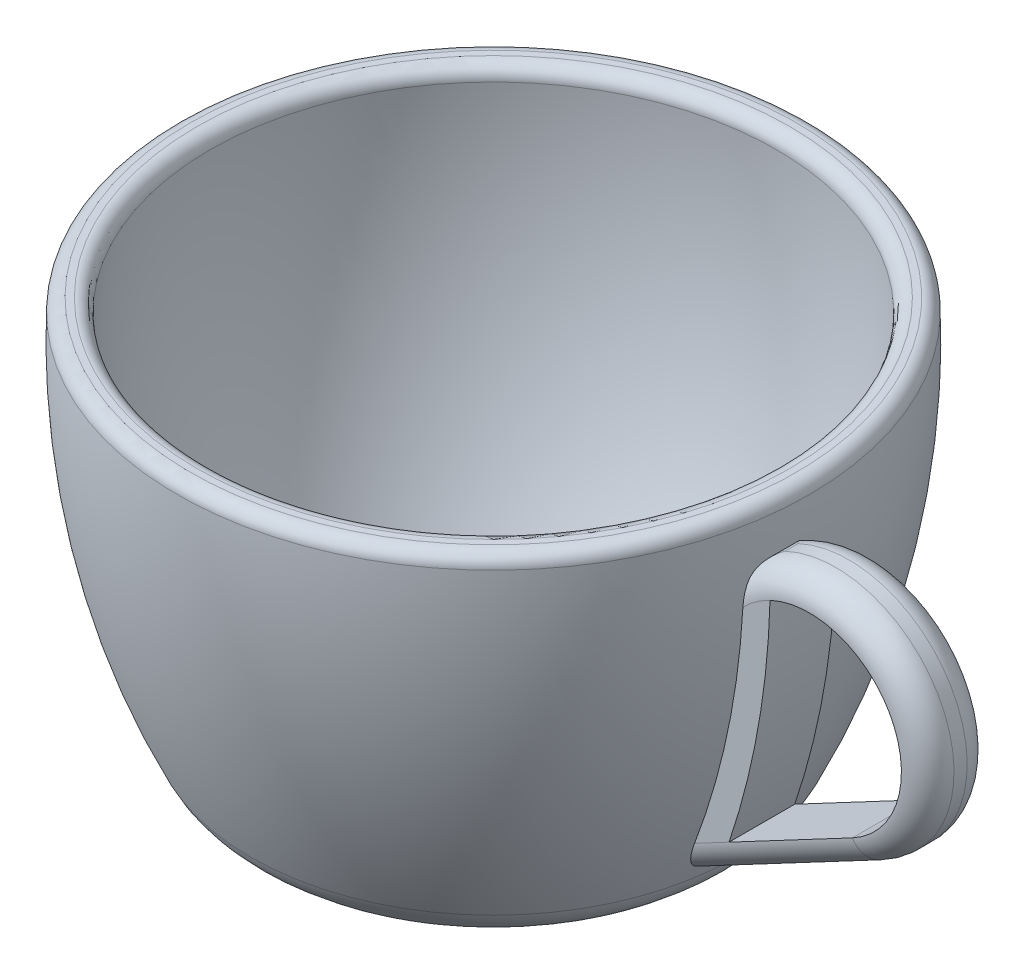
ISO-10303-21;
HEADER;
FILE_DESCRIPTION(('STEP AP214'),'2;1');
FILE_NAME('part.step','',(''),(''),'','','');
FILE_SCHEMA(('AUTOMOTIVE_DESIGN { 1 0 10303 214 1 1 1 1 }'));
ENDSEC;
DATA;
#1=APPLICATION_CONTEXT('core data for automotive mechanical design processes');
#2=APPLICATION_PROTOCOL_DEFINITION('international standard','automotive_design',2000,#1);
#3=PRODUCT_CONTEXT('',#1,'mechanical');
#4=PRODUCT('Part','Part','',(#3));
#5=PRODUCT_RELATED_PRODUCT_CATEGORY('part','',(#4));
#6=PRODUCT_DEFINITION_FORMATION('','',#4);
#7=PRODUCT_DEFINITION_CONTEXT('part definition',#1,'design');
#8=PRODUCT_DEFINITION('design','',#6,#7);
#9=PRODUCT_DEFINITION_SHAPE('','',#8);
#10=(LENGTH_UNIT() NAMED_UNIT(*) SI_UNIT(.MILLI.,.METRE.));
#11=(NAMED_UNIT(*) PLANE_ANGLE_UNIT() SI_UNIT($,.RADIAN.));
#12=(NAMED_UNIT(*) SI_UNIT($,.STERADIAN.) SOLID_ANGLE_UNIT());
#13=UNCERTAINTY_MEASURE_WITH_UNIT(LENGTH_MEASURE(1.E-05),#10,'distance_accuracy_value','');
#14=(GEOMETRIC_REPRESENTATION_CONTEXT(3) GLOBAL_UNCERTAINTY_ASSIGNED_CONTEXT((#13)) GLOBAL_UNIT_ASSIGNED_CONTEXT((#10,
#11,#12)) REPRESENTATION_CONTEXT('',''));
#15=CARTESIAN_POINT('',(0.,0.,0.));
#16=DIRECTION('',(0.,0.,1.));
#17=DIRECTION('',(1.,0.,0.));
#18=AXIS2_PLACEMENT_3D('',#15,#16,#17);
#19=CARTESIAN_POINT('',(-33.9344438469068,12.4931510468309,5.));
#20=DIRECTION('',(0.,0.,-1.));
#21=DIRECTION('',(-1.,0.,0.));
#22=AXIS2_PLACEMENT_3D('',#19,#20,#21);
#23=PLANE('',#22);
#24=CARTESIAN_POINT('',(-33.9344438469068,12.4931510468309,5.));
#25=DIRECTION('',(0.,0.,-1.));
#26=DIRECTION('',(-1.,0.,0.));
#27=AXIS2_PLACEMENT_3D('',#24,#25,#26);
#28=CIRCLE('',#27,58.0000000000086);
#29=CARTESIAN_POINT('',(23.979650500187,9.33757250131607,5.));
#30=VERTEX_POINT('',#29);
#31=CARTESIAN_POINT('',(20.3038871145309,-8.05443894612309,5.));
#32=VERTEX_POINT('',#31);
#33=EDGE_CURVE('E148',#30,#32,#28,.T.);
#34=ORIENTED_EDGE('',*,*,#33,.T.);
#35=DIRECTION('',(0.88350934420725,0.468413533854943,0.));
#36=VECTOR('',#35,1.);
#37=CARTESIAN_POINT('',(-13.5303709056327,-25.9924771440158,5.));
#38=LINE('',#37,#36);
#39=CARTESIAN_POINT('',(22.92475168972,-6.66492513342984,5.));
#40=VERTEX_POINT('',#39);
#41=EDGE_CURVE('E132',#32,#40,#38,.T.);
#42=ORIENTED_EDGE('',*,*,#41,.T.);
#43=CARTESIAN_POINT('',(-33.9344438469068,12.4931510468309,5.));
#44=DIRECTION('',(0.,0.,-1.));
#45=DIRECTION('',(-1.,0.,0.));
#46=AXIS2_PLACEMENT_3D('',#43,#44,#45);
#47=CIRCLE('',#46,60.0000000000086);
#48=CARTESIAN_POINT('',(26.0423836387926,10.8257684417625,5.));
#49=VERTEX_POINT('',#48);
#50=EDGE_CURVE('E140',#49,#40,#47,.T.);
#51=ORIENTED_EDGE('',*,*,#50,.F.);
#52=CARTESIAN_POINT('',(29.0384749984246,4.49936056961745,5.));
#53=DIRECTION('',(0.,0.,-1.));
#54=DIRECTION('',(-1.,0.,0.));
#55=AXIS2_PLACEMENT_3D('',#52,#53,#54);
#56=CIRCLE('',#55,6.99999999999999);
#57=EDGE_CURVE('E150',#49,#30,#56,.F.);
#58=ORIENTED_EDGE('',*,*,#57,.T.);
#59=EDGE_LOOP('',(#34,#42,#51,#58));
#60=FACE_BOUND('',#59,.T.);
#61=ADVANCED_FACE('F55',(#60),#23,.F.);
#62=CARTESIAN_POINT('',(-33.9344438469068,12.4931510468309,0.));
#63=DIRECTION('',(0.,0.,-1.));
#64=DIRECTION('',(-1.,0.,0.));
#65=AXIS2_PLACEMENT_3D('',#62,#63,#64);
#66=PLANE('',#65);
#67=CARTESIAN_POINT('',(-33.9344438469068,12.4931510468309,0.));
#68=DIRECTION('',(0.,0.,-1.));
#69=DIRECTION('',(-1.,0.,0.));
#70=AXIS2_PLACEMENT_3D('',#67,#68,#69);
#71=CIRCLE('',#70,60.0000000000086);
#72=CARTESIAN_POINT('',(26.0423836387926,10.8257684417625,0.));
#73=VERTEX_POINT('',#72);
#74=CARTESIAN_POINT('',(22.92475168972,-6.66492513342984,0.));
#75=VERTEX_POINT('',#74);
#76=EDGE_CURVE('E285',#73,#75,#71,.T.);
#77=ORIENTED_EDGE('',*,*,#76,.T.);
#78=DIRECTION('',(0.88350934420725,0.468413533854943,0.));
#79=VECTOR('',#78,1.);
#80=CARTESIAN_POINT('',(18.1812202280932,-9.17982138151238,0.));
#81=LINE('',#80,#79);
#82=CARTESIAN_POINT('',(20.3038871145309,-8.05443894612309,0.));
#83=VERTEX_POINT('',#82);
#84=EDGE_CURVE('E230',#75,#83,#81,.F.);
#85=ORIENTED_EDGE('',*,*,#84,.T.);
#86=CARTESIAN_POINT('',(-33.9344438469068,12.4931510468309,0.));
#87=DIRECTION('',(0.,0.,-1.));
#88=DIRECTION('',(-1.,0.,0.));
#89=AXIS2_PLACEMENT_3D('',#86,#87,#88);
#90=CIRCLE('',#89,58.0000000000086);
#91=CARTESIAN_POINT('',(23.979650500187,9.33757250131606,0.));
#92=VERTEX_POINT('',#91);
#93=EDGE_CURVE('E166',#92,#83,#90,.T.);
#94=ORIENTED_EDGE('',*,*,#93,.F.);
#95=CARTESIAN_POINT('',(29.0384749984246,4.49936056961745,0.));
#96=DIRECTION('',(0.,0.,-1.));
#97=DIRECTION('',(-1.,0.,0.));
#98=AXIS2_PLACEMENT_3D('',#95,#96,#97);
#99=CIRCLE('',#98,6.99999999999999);
#100=EDGE_CURVE('E228',#92,#73,#99,.T.);
#101=ORIENTED_EDGE('',*,*,#100,.T.);
#102=EDGE_LOOP('',(#77,#85,#94,#101));
#103=FACE_BOUND('',#102,.T.);
#104=ADVANCED_FACE('F202',(#103),#66,.T.);
#105=CARTESIAN_POINT('',(-33.9344438469068,12.4931510468309,5.));
#106=DIRECTION('',(0.,0.,-1.));
#107=DIRECTION('',(-1.,0.,0.));
#108=AXIS2_PLACEMENT_3D('',#105,#106,#107);
#109=CYLINDRICAL_SURFACE('',#108,58.0000000000086);
#110=DIRECTION('',(0.,0.,-1.));
#111=VECTOR('',#110,1.);
#112=CARTESIAN_POINT('',(19.1180472958031,-10.9468400699269,5.));
#113=LINE('',#112,#111);
#114=CARTESIAN_POINT('',(19.1180472958031,-10.9468400699269,3.));
#115=VERTEX_POINT('',#114);
#116=CARTESIAN_POINT('',(19.1180472958031,-10.9468400699269,2.));
#117=VERTEX_POINT('',#116);
#118=EDGE_CURVE('E177',#115,#117,#113,.T.);
#119=ORIENTED_EDGE('',*,*,#118,.F.);
#120=CARTESIAN_POINT('',(19.1180472958031,-10.9468400699269,3.));
#121=CARTESIAN_POINT('',(19.1180383720661,-10.9468591006645,3.04198652230094));
#122=CARTESIAN_POINT('',(19.1189104072404,-10.9448865424429,3.08396066699407));
#123=CARTESIAN_POINT('',(19.1223472936523,-10.9371060238736,3.16743222638179));
#124=CARTESIAN_POINT('',(19.124910079574,-10.9313027428937,3.20893015994375));
#125=CARTESIAN_POINT('',(19.1316210139958,-10.9160955011322,3.29063101706186));
#126=CARTESIAN_POINT('',(19.1357506655537,-10.9067335483823,3.3308433297919));
#127=CARTESIAN_POINT('',(19.1454799642096,-10.8846554072489,3.4101491778386));
#128=CARTESIAN_POINT('',(19.1510799638252,-10.8719384144874,3.44924244236623));
#129=CARTESIAN_POINT('',(19.169826745053,-10.8293145779611,3.56407889647573));
#130=CARTESIAN_POINT('',(19.1849609553938,-10.7948431604463,3.63784404124475));
#131=CARTESIAN_POINT('',(19.2194180851132,-10.7160888318405,3.77899202916436));
#132=CARTESIAN_POINT('',(19.2387541460896,-10.6717751284496,3.84635387326327));
#133=CARTESIAN_POINT('',(19.2918895993683,-10.5495030587468,4.00899183548718));
#134=CARTESIAN_POINT('',(19.3278504233503,-10.4663214193271,4.09962668267455));
#135=CARTESIAN_POINT('',(19.4044110303572,-10.2878946371221,4.26574056109083));
#136=CARTESIAN_POINT('',(19.4450209054874,-10.1926231994255,4.34118560097877));
#137=CARTESIAN_POINT('',(19.5192958606613,-10.0169488375787,4.4623574744141));
#138=CARTESIAN_POINT('',(19.5523873604535,-9.93822180984106,4.51091862792134));
#139=CARTESIAN_POINT('',(19.6197019820223,-9.77703350951446,4.60050237528889));
#140=CARTESIAN_POINT('',(19.6539257081746,-9.69457023356824,4.64152086373386));
#141=CARTESIAN_POINT('',(19.7577879171872,-9.44259857931204,4.75412991041568));
#142=CARTESIAN_POINT('',(19.8285339913527,-9.26870511122798,4.81514412981452));
#143=CARTESIAN_POINT('',(19.9334803560236,-9.00696919844892,4.88617957895021));
#144=CARTESIAN_POINT('',(19.9675018136656,-8.92153643109256,4.90620103971343));
#145=CARTESIAN_POINT('',(20.035538928121,-8.74948271775906,4.94046090184195));
#146=CARTESIAN_POINT('',(20.0695545846984,-8.66286173157012,4.9546991069882));
#147=CARTESIAN_POINT('',(20.1371415138695,-8.48951423289946,4.97736671419318));
#148=CARTESIAN_POINT('',(20.1707141616427,-8.402794151192,4.98584183538718));
#149=CARTESIAN_POINT('',(20.237557204388,-8.22889056279537,4.99715214068028));
#150=CARTESIAN_POINT('',(20.2708276573022,-8.14170715025212,4.9999884296908));
#151=CARTESIAN_POINT('',(20.3038871145309,-8.05443894612309,5.));
#152=B_SPLINE_CURVE_WITH_KNOTS('',3,(#120,#121,#122,#123,#124,#125,#126,#127,#128,#129,#130,
#131,#132,#133,#134,#135,#136,#137,#138,#139,#140,#141,#142,#143,#144,#145,#146,#147,#148,#149,
#150,#151),.UNSPECIFIED.,.F.,.F.,(4,2,2,2,2,2,2,2,2,2,2,2,2,2,2,4),(0.,0.125884252717793,
0.251615017080443,0.375905510099908,0.500225829148167,0.747458825417953,0.995476484935828,
1.37782245928309,1.76101475323589,2.05533907578022,2.3498231256771,2.93953314367444,
3.2217537689636,3.50398396886672,3.78394823763495,4.06385764287641),.UNSPECIFIED.);
#153=EDGE_CURVE('E222',#115,#32,#152,.T.);
#154=ORIENTED_EDGE('',*,*,#153,.T.);
#155=ORIENTED_EDGE('',*,*,#33,.F.);
#156=CARTESIAN_POINT('',(23.979650500187,9.33757250131607,5.));
#157=CARTESIAN_POINT('',(23.9855306458572,9.44542889756805,4.99999922222326));
#158=CARTESIAN_POINT('',(23.9911084251859,9.55340322261701,4.99629109998169));
#159=CARTESIAN_POINT('',(24.0016541328101,9.76915449911496,4.98035081185393));
#160=CARTESIAN_POINT('',(24.0066196331699,9.87692909442817,4.96808591807795));
#161=CARTESIAN_POINT('',(24.0157711850718,10.0882604575923,4.93434416829314));
#162=CARTESIAN_POINT('',(24.0199739576839,10.1918545175633,4.91311157699099));
#163=CARTESIAN_POINT('',(24.027735696474,10.3964412876877,4.8605071964157));
#164=CARTESIAN_POINT('',(24.0312951673708,10.4974359834134,4.82914341015939));
#165=CARTESIAN_POINT('',(24.036118809861,10.6448470238442,4.77423441654213));
#166=CARTESIAN_POINT('',(24.0376277747064,10.692829933206,4.75485929205889));
#167=CARTESIAN_POINT('',(24.040502354656,10.7878968805384,4.71325971507097));
#168=CARTESIAN_POINT('',(24.0418670375851,10.8349736353282,4.69101857688393));
#169=CARTESIAN_POINT('',(24.0431560559362,10.8813478619307,4.66735495396323));
#170=B_SPLINE_CURVE_WITH_KNOTS('',3,(#156,#157,#158,#159,#160,#161,#162,#163,#164,#165,#166,
#167,#168,#169),.UNSPECIFIED.,.F.,.F.,(4,2,2,2,2,2,4),(0.,0.324141067811307,0.649528754218161,
0.966573271004194,1.28336795220429,1.43859947817178,1.59477944512941),.UNSPECIFIED.);
#171=CARTESIAN_POINT('',(24.0431560559363,10.8813478619314,4.66735495396513));
#172=VERTEX_POINT('',#171);
#173=EDGE_CURVE('E211',#30,#172,#170,.T.);
#174=ORIENTED_EDGE('',*,*,#173,.T.);
#175=DIRECTION('',(0.,0.,-1.));
#176=VECTOR('',#175,1.);
#177=CARTESIAN_POINT('',(24.0431560559363,10.8813478619314,5.));
#178=LINE('',#177,#176);
#179=CARTESIAN_POINT('',(24.0431560559363,10.8813478619314,0.332645046034874));
#180=VERTEX_POINT('',#179);
#181=EDGE_CURVE('E191',#172,#180,#178,.T.);
#182=ORIENTED_EDGE('',*,*,#181,.T.);
#183=CARTESIAN_POINT('',(24.0431560559363,10.8813478619314,0.332645046034874));
#184=CARTESIAN_POINT('',(24.0389287776286,10.7281186675877,0.254496657091173));
#185=CARTESIAN_POINT('',(24.0338378779418,10.5679551165019,0.19210444475637));
#186=CARTESIAN_POINT('',(24.0220735191729,10.2421049468039,0.0956215084239027));
#187=CARTESIAN_POINT('',(24.0154275684948,10.0765531261709,0.0610806435948221));
#188=CARTESIAN_POINT('',(24.0037859415494,9.81534427392305,0.0248382672662205));
#189=CARTESIAN_POINT('',(23.9993279588872,9.72057337151516,0.0153890029875285));
#190=CARTESIAN_POINT('',(23.9898797316114,9.52972544003635,0.00294488873088613));
#191=CARTESIAN_POINT('',(23.9848848610897,9.43364452502137,1.17900879466671E-05));
#192=CARTESIAN_POINT('',(23.979650500187,9.33757250131609,0.));
#193=B_SPLINE_CURVE_WITH_KNOTS('',3,(#183,#184,#185,#186,#187,#188,#189,#190,#191,#192),
.UNSPECIFIED.,.F.,.F.,(4,2,2,2,4),(0.,0.513999061969984,1.01951415138709,1.30537715686424,
1.5939378301652),.UNSPECIFIED.);
#194=EDGE_CURVE('E184',#180,#92,#193,.T.);
#195=ORIENTED_EDGE('',*,*,#194,.T.);
#196=ORIENTED_EDGE('',*,*,#93,.T.);
#197=CARTESIAN_POINT('',(20.3038871145309,-8.05443894612309,0.));
#198=CARTESIAN_POINT('',(20.2587129076957,-8.1736943350833,4.00640838798604E-05));
#199=CARTESIAN_POINT('',(20.2131364149355,-8.29280164679401,0.00531935700981928));
#200=CARTESIAN_POINT('',(20.1214510633159,-8.53008137896897,0.0264157691534799));
#201=CARTESIAN_POINT('',(20.0753414982934,-8.64825209573898,0.042248954270796));
#202=CARTESIAN_POINT('',(19.9824914649804,-8.88394732182593,0.0847464253487183));
#203=CARTESIAN_POINT('',(19.9357496595705,-9.00145022581416,0.111528576821379));
#204=CARTESIAN_POINT('',(19.8426263253745,-9.23338397401962,0.176262742910312));
#205=CARTESIAN_POINT('',(19.7962445448154,-9.34781713486548,0.214206060130653));
#206=CARTESIAN_POINT('',(19.6930924521852,-9.6000640560021,0.312659237541656));
#207=CARTESIAN_POINT('',(19.636562657342,-9.73673286471966,0.376420880807846));
#208=CARTESIAN_POINT('',(19.5266417225377,-9.99979217887641,0.524035138890257));
#209=CARTESIAN_POINT('',(19.4732406937294,-10.1262156125797,0.607819668265291));
#210=CARTESIAN_POINT('',(19.3874861022327,-10.327452100725,0.769376797078972));
#211=CARTESIAN_POINT('',(19.3536527143185,-10.4063076440599,0.841299192245829));
#212=CARTESIAN_POINT('',(19.2902763648631,-10.55322645246,0.997218264634828));
#213=CARTESIAN_POINT('',(19.2607284719517,-10.6213021304641,1.0812008389062));
#214=CARTESIAN_POINT('',(19.2148304841641,-10.7266048797918,1.23833956572202));
#215=CARTESIAN_POINT('',(19.1970387015408,-10.7672667533558,1.30875513141013));
#216=CARTESIAN_POINT('',(19.166183562498,-10.8376193100259,1.45570012954377));
#217=CARTESIAN_POINT('',(19.153106051133,-10.8673428420051,1.53221040300944));
#218=CARTESIAN_POINT('',(19.1348664009172,-10.908744524781,1.67362722570798));
#219=CARTESIAN_POINT('',(19.1286273022107,-10.9228817748925,1.7376666583175));
#220=CARTESIAN_POINT('',(19.1223154259973,-10.9371780248553,1.83511955678588));
#221=CARTESIAN_POINT('',(19.120719082092,-10.940792225123,1.86795482380584));
#222=CARTESIAN_POINT('',(19.1185835240137,-10.9456264395008,1.93385562734035));
#223=CARTESIAN_POINT('',(19.1180449764815,-10.9468449438041,1.96692129589512));
#224=CARTESIAN_POINT('',(19.1180472958031,-10.9468400699269,2.));
#225=B_SPLINE_CURVE_WITH_KNOTS('',3,(#197,#198,#199,#200,#201,#202,#203,#204,#205,#206,#207,
#208,#209,#210,#211,#212,#213,#214,#215,#216,#217,#218,#219,#220,#221,#222,#223,#224),
.UNSPECIFIED.,.F.,.F.,(4,2,2,2,2,2,2,2,2,2,2,2,2,4),(0.,0.382473523411586,0.765530609468054,
1.15282468366985,1.53981775288919,2.02167556982793,2.50191763375422,2.83686492349636,
3.17142367425086,3.42024945605859,3.66832177185763,3.86515827904918,3.96428046960581,
4.06346510859768),.UNSPECIFIED.);
#226=EDGE_CURVE('E217',#83,#117,#225,.T.);
#227=ORIENTED_EDGE('',*,*,#226,.T.);
#228=EDGE_LOOP('',(#119,#154,#155,#174,#182,#195,#196,#227));
#229=FACE_BOUND('',#228,.T.);
#230=ADVANCED_FACE('F196',(#229),#109,.F.);
#231=CARTESIAN_POINT('',(19.1180472958031,-10.9468400699269,5.));
#232=DIRECTION('',(-0.468413533854943,0.88350934420725,0.));
#233=DIRECTION('',(-0.88350934420725,-0.468413533854943,0.));
#234=AXIS2_PLACEMENT_3D('',#231,#232,#233);
#235=PLANE('',#234);
#236=DIRECTION('',(0.,0.,-1.));
#237=VECTOR('',#236,1.);
#238=CARTESIAN_POINT('',(33.2541968031191,-3.4522235282478,5.));
#239=LINE('',#238,#237);
#240=CARTESIAN_POINT('',(33.2541968031191,-3.4522235282478,3.));
#241=VERTEX_POINT('',#240);
#242=CARTESIAN_POINT('',(33.2541968031191,-3.4522235282478,2.));
#243=VERTEX_POINT('',#242);
#244=EDGE_CURVE('E174',#241,#243,#239,.T.);
#245=ORIENTED_EDGE('',*,*,#244,.F.);
#246=DIRECTION('',(0.88350934420725,0.468413533854943,0.));
#247=VECTOR('',#246,1.);
#248=CARTESIAN_POINT('',(19.1180472958031,-10.9468400699269,3.));
#249=LINE('',#248,#247);
#250=EDGE_CURVE('E182',#241,#115,#249,.F.);
#251=ORIENTED_EDGE('',*,*,#250,.T.);
#252=ORIENTED_EDGE('',*,*,#118,.T.);
#253=DIRECTION('',(0.88350934420725,0.468413533854943,0.));
#254=VECTOR('',#253,1.);
#255=CARTESIAN_POINT('',(33.2541968031191,-3.4522235282478,2.));
#256=LINE('',#255,#254);
#257=EDGE_CURVE('E149',#117,#243,#256,.T.);
#258=ORIENTED_EDGE('',*,*,#257,.T.);
#259=EDGE_LOOP('',(#245,#251,#252,#258));
#260=FACE_BOUND('',#259,.T.);
#261=ADVANCED_FACE('F201',(#260),#235,.F.);
#262=CARTESIAN_POINT('',(29.0384749984246,4.49936056961745,5.));
#263=DIRECTION('',(0.,0.,-1.));
#264=DIRECTION('',(-1.,0.,0.));
#265=AXIS2_PLACEMENT_3D('',#262,#263,#264);
#266=CYLINDRICAL_SURFACE('',#265,8.99999999999999);
#267=DIRECTION('',(0.,0.,-1.));
#268=VECTOR('',#267,1.);
#269=CARTESIAN_POINT('',(25.1863575360406,12.6333135480896,5.));
#270=LINE('',#269,#268);
#271=CARTESIAN_POINT('',(25.1863575360406,12.6333135480896,2.));
#272=VERTEX_POINT('',#271);
#273=CARTESIAN_POINT('',(25.1863575360406,12.6333135480896,3.));
#274=VERTEX_POINT('',#273);
#275=EDGE_CURVE('E65',#272,#274,#270,.F.);
#276=ORIENTED_EDGE('',*,*,#275,.T.);
#277=CARTESIAN_POINT('',(29.0384749984246,4.49936056961745,3.));
#278=DIRECTION('',(0.,0.,-1.));
#279=DIRECTION('',(-1.,0.,0.));
#280=AXIS2_PLACEMENT_3D('',#277,#278,#279);
#281=CIRCLE('',#280,8.99999999999999);
#282=EDGE_CURVE('E12',#274,#241,#281,.T.);
#283=ORIENTED_EDGE('',*,*,#282,.T.);
#284=ORIENTED_EDGE('',*,*,#244,.T.);
#285=CARTESIAN_POINT('',(29.0384749984246,4.49936056961745,2.));
#286=DIRECTION('',(0.,0.,-1.));
#287=DIRECTION('',(-1.,0.,0.));
#288=AXIS2_PLACEMENT_3D('',#285,#286,#287);
#289=CIRCLE('',#288,8.99999999999999);
#290=EDGE_CURVE('E76',#243,#272,#289,.F.);
#291=ORIENTED_EDGE('',*,*,#290,.T.);
#292=EDGE_LOOP('',(#276,#283,#284,#291));
#293=FACE_BOUND('',#292,.T.);
#294=ADVANCED_FACE('F267',(#293),#266,.T.);
#295=CARTESIAN_POINT('',(-33.9344438469068,12.4931510468309,5.));
#296=DIRECTION('',(0.,0.,-1.));
#297=DIRECTION('',(-1.,0.,0.));
#298=AXIS2_PLACEMENT_3D('',#295,#296,#297);
#299=CYLINDRICAL_SURFACE('',#298,60.0000000000086);
#300=ORIENTED_EDGE('',*,*,#76,.F.);
#301=DIRECTION('',(0.,0.,-1.));
#302=VECTOR('',#301,1.);
#303=CARTESIAN_POINT('',(26.0423836387926,10.8257684417625,5.));
#304=LINE('',#303,#302);
#305=EDGE_CURVE('E160',#49,#73,#304,.T.);
#306=ORIENTED_EDGE('',*,*,#305,.F.);
#307=ORIENTED_EDGE('',*,*,#50,.T.);
#308=DIRECTION('',(0.,0.,-1.));
#309=VECTOR('',#308,1.);
#310=CARTESIAN_POINT('',(22.92475168972,-6.66492513342984,5.));
#311=LINE('',#310,#309);
#312=EDGE_CURVE('E157',#40,#75,#311,.T.);
#313=ORIENTED_EDGE('',*,*,#312,.T.);
#314=EDGE_LOOP('',(#300,#306,#307,#313));
#315=FACE_BOUND('',#314,.T.);
#316=ADVANCED_FACE('F156',(#315),#299,.T.);
#317=CARTESIAN_POINT('',(22.92475168972,-6.66492513342984,5.));
#318=DIRECTION('',(-0.468413533854944,0.883509344207249,0.));
#319=DIRECTION('',(-0.883509344207249,-0.468413533854944,0.));
#320=AXIS2_PLACEMENT_3D('',#317,#318,#319);
#321=PLANE('',#320);
#322=DIRECTION('',(0.883509344207249,0.468413533854944,0.));
#323=VECTOR('',#322,1.);
#324=CARTESIAN_POINT('',(22.92475168972,-6.66492513342984,0.));
#325=LINE('',#324,#323);
#326=CARTESIAN_POINT('',(32.3173697354092,-1.6852048398333,0.));
#327=VERTEX_POINT('',#326);
#328=EDGE_CURVE('E165',#75,#327,#325,.T.);
#329=ORIENTED_EDGE('',*,*,#328,.F.);
#330=ORIENTED_EDGE('',*,*,#312,.F.);
#331=DIRECTION('',(0.883509344207249,0.468413533854944,0.));
#332=VECTOR('',#331,1.);
#333=CARTESIAN_POINT('',(22.92475168972,-6.66492513342984,5.));
#334=LINE('',#333,#332);
#335=CARTESIAN_POINT('',(32.3173697354092,-1.6852048398333,5.));
#336=VERTEX_POINT('',#335);
#337=EDGE_CURVE('E128',#40,#336,#334,.T.);
#338=ORIENTED_EDGE('',*,*,#337,.T.);
#339=DIRECTION('',(0.,0.,-1.));
#340=VECTOR('',#339,1.);
#341=CARTESIAN_POINT('',(32.3173697354092,-1.6852048398333,5.));
#342=LINE('',#341,#340);
#343=EDGE_CURVE('E167',#336,#327,#342,.T.);
#344=ORIENTED_EDGE('',*,*,#343,.T.);
#345=EDGE_LOOP('',(#329,#330,#338,#344));
#346=FACE_BOUND('',#345,.T.);
#347=ADVANCED_FACE('F163',(#346),#321,.T.);
#348=CARTESIAN_POINT('',(29.0384749984246,4.49936056961745,5.));
#349=DIRECTION('',(0.,0.,-1.));
#350=DIRECTION('',(-1.,0.,0.));
#351=AXIS2_PLACEMENT_3D('',#348,#349,#350);
#352=CYLINDRICAL_SURFACE('',#351,6.99999999999999);
#353=CARTESIAN_POINT('',(29.0384749984246,4.49936056961745,0.));
#354=DIRECTION('',(0.,0.,1.));
#355=DIRECTION('',(-1.,0.,0.));
#356=AXIS2_PLACEMENT_3D('',#353,#354,#355);
#357=CIRCLE('',#356,6.99999999999999);
#358=EDGE_CURVE('E161',#327,#73,#357,.T.);
#359=ORIENTED_EDGE('',*,*,#358,.F.);
#360=ORIENTED_EDGE('',*,*,#343,.F.);
#361=CARTESIAN_POINT('',(29.0384749984246,4.49936056961745,5.));
#362=DIRECTION('',(0.,0.,1.));
#363=DIRECTION('',(-1.,0.,0.));
#364=AXIS2_PLACEMENT_3D('',#361,#362,#363);
#365=CIRCLE('',#364,6.99999999999999);
#366=EDGE_CURVE('E139',#336,#49,#365,.T.);
#367=ORIENTED_EDGE('',*,*,#366,.T.);
#368=ORIENTED_EDGE('',*,*,#305,.T.);
#369=EDGE_LOOP('',(#359,#360,#367,#368));
#370=FACE_BOUND('',#369,.T.);
#371=ADVANCED_FACE('F294',(#370),#352,.F.);
#372=CARTESIAN_POINT('',(18.1812202280932,-9.17982138151238,2.));
#373=DIRECTION('',(-0.88350934420725,-0.468413533854943,0.));
#374=DIRECTION('',(0.468413533854943,-0.88350934420725,0.));
#375=AXIS2_PLACEMENT_3D('',#372,#373,#374);
#376=CYLINDRICAL_SURFACE('',#375,2.);
#377=ORIENTED_EDGE('',*,*,#84,.F.);
#378=ORIENTED_EDGE('',*,*,#328,.T.);
#379=CARTESIAN_POINT('',(32.3173697354092,-1.6852048398333,2.));
#380=DIRECTION('',(0.883509344207249,0.468413533854943,0.));
#381=DIRECTION('',(-0.468413533854943,0.883509344207249,0.));
#382=AXIS2_PLACEMENT_3D('',#379,#380,#381);
#383=CIRCLE('',#382,2.);
#384=EDGE_CURVE('E60',#243,#327,#383,.T.);
#385=ORIENTED_EDGE('',*,*,#384,.F.);
#386=ORIENTED_EDGE('',*,*,#257,.F.);
#387=ORIENTED_EDGE('',*,*,#226,.F.);
#388=EDGE_LOOP('',(#377,#378,#385,#386,#387));
#389=FACE_BOUND('',#388,.T.);
#390=ADVANCED_FACE('F57',(#389),#376,.T.);
#391=CARTESIAN_POINT('',(29.0384749984246,4.49936056961745,2.));
#392=DIRECTION('',(0.,0.,-1.));
#393=DIRECTION('',(-1.,0.,0.));
#394=AXIS2_PLACEMENT_3D('',#391,#392,#393);
#395=TOROIDAL_SURFACE('',#394,6.99999999999999,2.);
#396=ORIENTED_EDGE('',*,*,#100,.F.);
#397=ORIENTED_EDGE('',*,*,#194,.F.);
#398=CARTESIAN_POINT('',(24.0431560559363,10.8813478619314,0.332645046034874));
#399=CARTESIAN_POINT('',(24.0449469360407,10.9455323073726,0.365406272707039));
#400=CARTESIAN_POINT('',(24.049790109323,11.0087372921268,0.399756243829132));
#401=CARTESIAN_POINT('',(24.0651039062935,11.132805995558,0.471121477036282));
#402=CARTESIAN_POINT('',(24.0755662923364,11.1936730020538,0.508132769064018));
#403=CARTESIAN_POINT('',(24.1145221302421,11.3717014877315,0.622050549354462));
#404=CARTESIAN_POINT('',(24.1506199525781,11.4851269801904,0.702276327586801));
#405=CARTESIAN_POINT('',(24.2494501325954,11.7232149005671,0.886602875470326));
#406=CARTESIAN_POINT('',(24.3162400298348,11.8450510668328,0.992128583679919));
#407=CARTESIAN_POINT('',(24.4703347709174,12.0696531681688,1.20891216546471));
#408=CARTESIAN_POINT('',(24.5576949789214,12.1723662743689,1.32018486456254));
#409=CARTESIAN_POINT('',(24.7313313690651,12.3400125600316,1.52511417571992));
#410=CARTESIAN_POINT('',(24.8148939328614,12.4084196044122,1.61827829415092));
#411=CARTESIAN_POINT('',(24.9909618840119,12.5304509548674,1.80542269235196));
#412=CARTESIAN_POINT('',(25.0834446665615,12.5841113665701,1.89940038696939));
#413=CARTESIAN_POINT('',(25.1817766856437,12.6311387962407,1.99552791392429));
#414=CARTESIAN_POINT('',(25.1840661074262,12.6322283665568,1.99776398553697));
#415=CARTESIAN_POINT('',(25.1863575360406,12.6333135480896,2.));
#416=B_SPLINE_CURVE_WITH_KNOTS('',3,(#398,#399,#400,#401,#402,#403,#404,#405,#406,#407,#408,
#409,#410,#411,#412,#413,#414,#415),.UNSPECIFIED.,.F.,.F.,(4,2,2,2,2,2,2,2,4),(0.,
0.216043722834271,0.431771591245965,0.860435974206261,1.38125302790076,1.90348819381155,
2.33038472350339,2.75622653478234,2.7663683961536),.UNSPECIFIED.);
#417=EDGE_CURVE('E241',#272,#180,#416,.F.);
#418=ORIENTED_EDGE('',*,*,#417,.F.);
#419=ORIENTED_EDGE('',*,*,#290,.F.);
#420=ORIENTED_EDGE('',*,*,#384,.T.);
#421=ORIENTED_EDGE('',*,*,#358,.T.);
#422=EDGE_LOOP('',(#396,#397,#418,#419,#420,#421));
#423=FACE_BOUND('',#422,.T.);
#424=ADVANCED_FACE('F193',(#423),#395,.T.);
#425=CARTESIAN_POINT('',(26.0423836387926,10.8257684417624,5.));
#426=DIRECTION('',(0.,0.,1.));
#427=DIRECTION('',(1.,0.,0.));
#428=AXIS2_PLACEMENT_3D('',#425,#426,#427);
#429=CYLINDRICAL_SURFACE('',#428,2.);
#430=ORIENTED_EDGE('',*,*,#417,.T.);
#431=ORIENTED_EDGE('',*,*,#181,.F.);
#432=CARTESIAN_POINT('',(24.0431560559363,10.8813478619314,4.66735495396513));
#433=CARTESIAN_POINT('',(24.0449469360407,10.9455323073726,4.63459372729296));
#434=CARTESIAN_POINT('',(24.049790109323,11.0087372921268,4.60024375617087));
#435=CARTESIAN_POINT('',(24.0651039062935,11.132805995558,4.52887852296372));
#436=CARTESIAN_POINT('',(24.0755662923364,11.1936730020538,4.49186723093598));
#437=CARTESIAN_POINT('',(24.1145221302421,11.3717014877314,4.37794945064554));
#438=CARTESIAN_POINT('',(24.1506199525781,11.4851269801904,4.2977236724132));
#439=CARTESIAN_POINT('',(24.2494501325954,11.7232149005671,4.11339712452967));
#440=CARTESIAN_POINT('',(24.3162400298348,11.8450510668328,4.00787141632007));
#441=CARTESIAN_POINT('',(24.4703347709174,12.0696531681688,3.79108783453529));
#442=CARTESIAN_POINT('',(24.5576949789214,12.1723662743689,3.6798151354375));
#443=CARTESIAN_POINT('',(24.7313313690651,12.3400125600316,3.47488582428005));
#444=CARTESIAN_POINT('',(24.8148939328613,12.4084196044122,3.38172170584897));
#445=CARTESIAN_POINT('',(24.990961884012,12.5304509548674,3.19457730764815));
#446=CARTESIAN_POINT('',(25.0834446665618,12.5841113665703,3.10059961303104));
#447=CARTESIAN_POINT('',(25.1817766856437,12.6311387962407,3.00447208607573));
#448=CARTESIAN_POINT('',(25.1840661074262,12.6322283665568,3.00223601446304));
#449=CARTESIAN_POINT('',(25.1863575360406,12.6333135480896,3.));
#450=B_SPLINE_CURVE_WITH_KNOTS('',3,(#432,#433,#434,#435,#436,#437,#438,#439,#440,#441,#442,
#443,#444,#445,#446,#447,#448,#449),.UNSPECIFIED.,.F.,.F.,(4,2,2,2,2,2,2,2,4),(0.,
0.216043722834269,0.431771591245958,0.860435974206262,1.38125302790077,1.90348819381155,
2.33038472350339,2.75622653478234,2.7663683961536),.UNSPECIFIED.);
#451=EDGE_CURVE('E235',#274,#172,#450,.F.);
#452=ORIENTED_EDGE('',*,*,#451,.F.);
#453=ORIENTED_EDGE('',*,*,#275,.F.);
#454=EDGE_LOOP('',(#430,#431,#452,#453));
#455=FACE_BOUND('',#454,.T.);
#456=ADVANCED_FACE('F246',(#455),#429,.T.);
#457=CARTESIAN_POINT('',(29.0384749984246,4.49936056961745,3.));
#458=DIRECTION('',(0.,0.,-1.));
#459=DIRECTION('',(-1.,0.,0.));
#460=AXIS2_PLACEMENT_3D('',#457,#458,#459);
#461=TOROIDAL_SURFACE('',#460,6.99999999999999,2.);
#462=ORIENTED_EDGE('',*,*,#57,.F.);
#463=ORIENTED_EDGE('',*,*,#366,.F.);
#464=CARTESIAN_POINT('',(32.3173697354092,-1.6852048398333,3.));
#465=DIRECTION('',(-0.883509344207251,-0.46841353385494,0.));
#466=DIRECTION('',(0.468413533854941,-0.883509344207251,0.));
#467=AXIS2_PLACEMENT_3D('',#464,#465,#466);
#468=CIRCLE('',#467,2.);
#469=EDGE_CURVE('E135',#241,#336,#468,.T.);
#470=ORIENTED_EDGE('',*,*,#469,.F.);
#471=ORIENTED_EDGE('',*,*,#282,.F.);
#472=ORIENTED_EDGE('',*,*,#451,.T.);
#473=ORIENTED_EDGE('',*,*,#173,.F.);
#474=EDGE_LOOP('',(#462,#463,#470,#471,#472,#473));
#475=FACE_BOUND('',#474,.T.);
#476=ADVANCED_FACE('F248',(#475),#461,.T.);
#477=CARTESIAN_POINT('',(-13.5303709056327,-25.9924771440158,3.));
#478=DIRECTION('',(0.88350934420725,0.468413533854943,0.));
#479=DIRECTION('',(-0.468413533854943,0.88350934420725,0.));
#480=AXIS2_PLACEMENT_3D('',#477,#478,#479);
#481=CYLINDRICAL_SURFACE('',#480,2.);
#482=ORIENTED_EDGE('',*,*,#153,.F.);
#483=ORIENTED_EDGE('',*,*,#250,.F.);
#484=ORIENTED_EDGE('',*,*,#469,.T.);
#485=ORIENTED_EDGE('',*,*,#337,.F.);
#486=ORIENTED_EDGE('',*,*,#41,.F.);
#487=EDGE_LOOP('',(#482,#483,#484,#485,#486));
#488=FACE_BOUND('',#487,.T.);
#489=ADVANCED_FACE('F131',(#488),#481,.T.);
#490=CLOSED_SHELL('',(#61,#104,#230,#261,#294,#316,#347,#371,#390,#424,#456,#476,#489));
#491=MANIFOLD_SOLID_BREP('B2',#490);
#492=CARTESIAN_POINT('',(0.,-15.25,0.));
#493=DIRECTION('',(0.,-1.,0.));
#494=DIRECTION('',(1.,0.,0.));
#495=AXIS2_PLACEMENT_3D('',#492,#493,#494);
#496=PLANE('',#495);
#497=CARTESIAN_POINT('',(0.,-15.25,0.));
#498=DIRECTION('',(0.,-1.,0.));
#499=DIRECTION('',(1.,0.,0.));
#500=AXIS2_PLACEMENT_3D('',#497,#498,#499);
#501=CIRCLE('',#500,13.9377723171893);
#502=CARTESIAN_POINT('',(13.9377723171893,-15.25,0.));
#503=VERTEX_POINT('',#502);
#504=EDGE_CURVE('E389',#503,#503,#501,.T.);
#505=ORIENTED_EDGE('',*,*,#504,.T.);
#506=EDGE_LOOP('',(#505));
#507=FACE_BOUND('',#506,.T.);
#508=ADVANCED_FACE('F381',(#507),#496,.T.);
#509=CARTESIAN_POINT('',(0.,15.25,0.));
#510=DIRECTION('',(0.,1.,0.));
#511=DIRECTION('',(-1.,0.,0.));
#512=AXIS2_PLACEMENT_3D('',#509,#510,#511);
#513=PLANE('',#512);
#514=CARTESIAN_POINT('',(0.,15.25,0.));
#515=DIRECTION('',(0.,1.,0.));
#516=DIRECTION('',(-1.,0.,0.));
#517=AXIS2_PLACEMENT_3D('',#514,#515,#516);
#518=CIRCLE('',#517,23.0384749984246);
#519=CARTESIAN_POINT('',(-23.0384749984246,15.25,0.));
#520=VERTEX_POINT('',#519);
#521=EDGE_CURVE('E399',#520,#520,#518,.T.);
#522=ORIENTED_EDGE('',*,*,#521,.T.);
#523=EDGE_LOOP('',(#522));
#524=FACE_BOUND('',#523,.T.);
#525=CARTESIAN_POINT('',(0.,15.25,0.));
#526=DIRECTION('',(0.,1.,0.));
#527=DIRECTION('',(-1.,0.,0.));
#528=AXIS2_PLACEMENT_3D('',#525,#526,#527);
#529=CIRCLE('',#528,22.5382352267542);
#530=CARTESIAN_POINT('',(-22.5382352267542,15.25,0.));
#531=VERTEX_POINT('',#530);
#532=EDGE_CURVE('E405',#531,#531,#529,.F.);
#533=ORIENTED_EDGE('',*,*,#532,.T.);
#534=EDGE_LOOP('',(#533));
#535=FACE_BOUND('',#534,.T.);
#536=ADVANCED_FACE('F431',(#524,#535),#513,.T.);
#537=CARTESIAN_POINT('',(0.,12.4931510468291,0.));
#538=DIRECTION('',(0.,-1.,0.));
#539=DIRECTION('',(1.,0.,0.));
#540=AXIS2_PLACEMENT_3D('',#537,#538,#539);
#541=DEGENERATE_TOROIDAL_SURFACE('',#540,33.9344438468982,58.,.F.);
#542=CARTESIAN_POINT('',(0.,-12.3955802874367,0.));
#543=DIRECTION('',(0.,1.,0.));
#544=DIRECTION('',(-1.,0.,0.));
#545=AXIS2_PLACEMENT_3D('',#542,#543,#544);
#546=CIRCLE('',#545,18.454019125122);
#547=CARTESIAN_POINT('',(-18.4540191251221,-12.3955802874367,0.));
#548=VERTEX_POINT('',#547);
#549=EDGE_CURVE('E54',#548,#548,#546,.T.);
#550=ORIENTED_EDGE('',*,*,#549,.T.);
#551=EDGE_LOOP('',(#550));
#552=FACE_BOUND('',#551,.T.);
#553=CARTESIAN_POINT('',(0.,14.2808219114591,0.));
#554=DIRECTION('',(0.,-1.,0.));
#555=DIRECTION('',(1.,0.,0.));
#556=AXIS2_PLACEMENT_3D('',#553,#554,#555);
#557=CIRCLE('',#556,24.0379998904479);
#558=CARTESIAN_POINT('',(24.0379998904478,14.2808219114591,0.));
#559=VERTEX_POINT('',#558);
#560=EDGE_CURVE('E409',#559,#559,#557,.T.);
#561=ORIENTED_EDGE('',*,*,#560,.T.);
#562=EDGE_LOOP('',(#561));
#563=FACE_BOUND('',#562,.T.);
#564=ADVANCED_FACE('F422',(#552,#563),#541,.F.);
#565=CARTESIAN_POINT('',(0.,-12.75,0.));
#566=DIRECTION('',(0.,-1.,0.));
#567=DIRECTION('',(1.,0.,0.));
#568=AXIS2_PLACEMENT_3D('',#565,#566,#567);
#569=PLANE('',#568);
#570=CARTESIAN_POINT('',(0.,-12.75,0.));
#571=DIRECTION('',(0.,-1.,0.));
#572=DIRECTION('',(1.,0.,0.));
#573=AXIS2_PLACEMENT_3D('',#570,#571,#572);
#574=CIRCLE('',#573,15.492606694551);
#575=CARTESIAN_POINT('',(15.492606694551,-12.75,0.));
#576=VERTEX_POINT('',#575);
#577=EDGE_CURVE('E413',#576,#576,#574,.T.);
#578=ORIENTED_EDGE('',*,*,#577,.F.);
#579=EDGE_LOOP('',(#578));
#580=FACE_BOUND('',#579,.T.);
#581=ADVANCED_FACE('F420',(#580),#569,.F.);
#582=CARTESIAN_POINT('',(0.,12.4931510468291,0.));
#583=DIRECTION('',(0.,-1.,0.));
#584=DIRECTION('',(1.,0.,0.));
#585=AXIS2_PLACEMENT_3D('',#582,#583,#584);
#586=DEGENERATE_TOROIDAL_SURFACE('',#585,33.9344438468982,55.5,.F.);
#587=CARTESIAN_POINT('',(0.,14.2189053282625,0.));
#588=DIRECTION('',(0.,-1.,0.));
#589=DIRECTION('',(1.,0.,0.));
#590=AXIS2_PLACEMENT_3D('',#587,#588,#589);
#591=CIRCLE('',#590,21.5387187829728);
#592=CARTESIAN_POINT('',(21.5387187829728,14.2189053282625,0.));
#593=VERTEX_POINT('',#592);
#594=EDGE_CURVE('E394',#593,#593,#591,.F.);
#595=ORIENTED_EDGE('',*,*,#594,.T.);
#596=EDGE_LOOP('',(#595));
#597=FACE_BOUND('',#596,.T.);
#598=ORIENTED_EDGE('',*,*,#577,.T.);
#599=EDGE_LOOP('',(#598));
#600=FACE_BOUND('',#599,.T.);
#601=ADVANCED_FACE('F418',(#597,#600),#586,.T.);
#602=CARTESIAN_POINT('',(0.,14.25,0.));
#603=DIRECTION('',(0.,1.,0.));
#604=DIRECTION('',(-1.,0.,0.));
#605=AXIS2_PLACEMENT_3D('',#602,#603,#604);
#606=TOROIDAL_SURFACE('',#605,23.0384749984246,1.);
#607=ORIENTED_EDGE('',*,*,#521,.F.);
#608=EDGE_LOOP('',(#607));
#609=FACE_BOUND('',#608,.T.);
#610=ORIENTED_EDGE('',*,*,#560,.F.);
#611=EDGE_LOOP('',(#610));
#612=FACE_BOUND('',#611,.T.);
#613=ADVANCED_FACE('F427',(#609,#612),#606,.T.);
#614=CARTESIAN_POINT('',(0.,14.25,0.));
#615=DIRECTION('',(0.,1.,0.));
#616=DIRECTION('',(-1.,0.,0.));
#617=AXIS2_PLACEMENT_3D('',#614,#615,#616);
#618=TOROIDAL_SURFACE('',#617,22.5382352267542,1.);
#619=ORIENTED_EDGE('',*,*,#594,.F.);
#620=EDGE_LOOP('',(#619));
#621=FACE_BOUND('',#620,.T.);
#622=ORIENTED_EDGE('',*,*,#532,.F.);
#623=EDGE_LOOP('',(#622));
#624=FACE_BOUND('',#623,.T.);
#625=ADVANCED_FACE('F444',(#621,#624),#618,.T.);
#626=CARTESIAN_POINT('',(0.,-10.25,0.));
#627=DIRECTION('',(0.,-1.,0.));
#628=DIRECTION('',(1.,0.,0.));
#629=AXIS2_PLACEMENT_3D('',#626,#627,#628);
#630=TOROIDAL_SURFACE('',#629,13.9377723171893,5.);
#631=ORIENTED_EDGE('',*,*,#549,.F.);
#632=EDGE_LOOP('',(#631));
#633=FACE_BOUND('',#632,.T.);
#634=ORIENTED_EDGE('',*,*,#504,.F.);
#635=EDGE_LOOP('',(#634));
#636=FACE_BOUND('',#635,.T.);
#637=ADVANCED_FACE('F383',(#633,#636),#630,.T.);
#638=CLOSED_SHELL('',(#508,#536,#564,#581,#601,#613,#625,#637));
#639=MANIFOLD_SOLID_BREP('B6',#638);
#640=ADVANCED_BREP_SHAPE_REPRESENTATION('',(#18,#491,#639),#14);
#641=SHAPE_DEFINITION_REPRESENTATION(#9,#640);
ENDSEC;
END-ISO-10303-21;
